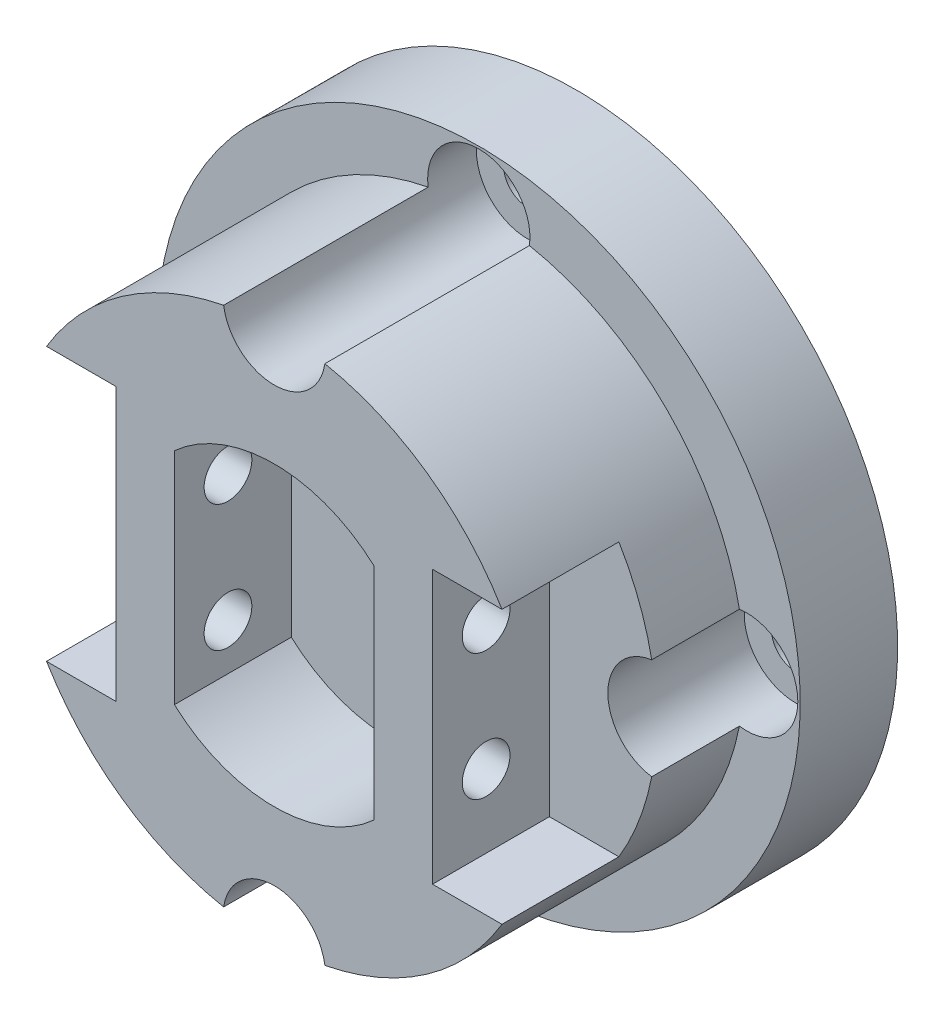
ISO-10303-21;
HEADER;
FILE_DESCRIPTION(('STEP AP214'),'2;1');
FILE_NAME('part.step','',(''),(''),'','','');
FILE_SCHEMA(('AUTOMOTIVE_DESIGN { 1 0 10303 214 1 1 1 1 }'));
ENDSEC;
DATA;
#1=APPLICATION_CONTEXT('core data for automotive mechanical design processes');
#2=APPLICATION_PROTOCOL_DEFINITION('international standard','automotive_design',2000,#1);
#3=PRODUCT_CONTEXT('',#1,'mechanical');
#4=PRODUCT('Part','Part','',(#3));
#5=PRODUCT_RELATED_PRODUCT_CATEGORY('part','',(#4));
#6=PRODUCT_DEFINITION_FORMATION('','',#4);
#7=PRODUCT_DEFINITION_CONTEXT('part definition',#1,'design');
#8=PRODUCT_DEFINITION('design','',#6,#7);
#9=PRODUCT_DEFINITION_SHAPE('','',#8);
#10=(LENGTH_UNIT() NAMED_UNIT(*) SI_UNIT(.MILLI.,.METRE.));
#11=(NAMED_UNIT(*) PLANE_ANGLE_UNIT() SI_UNIT($,.RADIAN.));
#12=(NAMED_UNIT(*) SI_UNIT($,.STERADIAN.) SOLID_ANGLE_UNIT());
#13=UNCERTAINTY_MEASURE_WITH_UNIT(LENGTH_MEASURE(1.E-05),#10,'distance_accuracy_value','');
#14=(GEOMETRIC_REPRESENTATION_CONTEXT(3) GLOBAL_UNCERTAINTY_ASSIGNED_CONTEXT((#13)) GLOBAL_UNIT_ASSIGNED_CONTEXT((#10,
#11,#12)) REPRESENTATION_CONTEXT('',''));
#15=CARTESIAN_POINT('',(0.,0.,0.));
#16=DIRECTION('',(0.,0.,1.));
#17=DIRECTION('',(1.,0.,0.));
#18=AXIS2_PLACEMENT_3D('',#15,#16,#17);
#19=CARTESIAN_POINT('',(0.,-27.5,36.));
#20=DIRECTION('',(0.,0.,-1.));
#21=DIRECTION('',(1.,0.,0.));
#22=AXIS2_PLACEMENT_3D('',#19,#20,#21);
#23=CYLINDRICAL_SURFACE('',#22,2.45);
#24=CARTESIAN_POINT('',(0.,-27.5,0.));
#25=DIRECTION('',(0.,0.,1.));
#26=DIRECTION('',(1.,0.,0.));
#27=AXIS2_PLACEMENT_3D('',#24,#25,#26);
#28=CIRCLE('',#27,2.45);
#29=CARTESIAN_POINT('',(2.45000000000001,-27.5,0.));
#30=VERTEX_POINT('',#29);
#31=EDGE_CURVE('E354',#30,#30,#28,.T.);
#32=ORIENTED_EDGE('',*,*,#31,.F.);
#33=EDGE_LOOP('',(#32));
#34=FACE_BOUND('',#33,.T.);
#35=CARTESIAN_POINT('',(0.,-27.5,5.));
#36=DIRECTION('',(0.,0.,-1.));
#37=DIRECTION('',(-1.,0.,0.));
#38=AXIS2_PLACEMENT_3D('',#35,#36,#37);
#39=CIRCLE('',#38,2.45);
#40=CARTESIAN_POINT('',(-2.45,-27.5,5.));
#41=VERTEX_POINT('',#40);
#42=EDGE_CURVE('E251',#41,#41,#39,.F.);
#43=ORIENTED_EDGE('',*,*,#42,.T.);
#44=EDGE_LOOP('',(#43));
#45=FACE_BOUND('',#44,.T.);
#46=ADVANCED_FACE('F34',(#34,#45),#23,.F.);
#47=CARTESIAN_POINT('',(27.5,0.,36.));
#48=DIRECTION('',(0.,0.,-1.));
#49=DIRECTION('',(1.,0.,0.));
#50=AXIS2_PLACEMENT_3D('',#47,#48,#49);
#51=CYLINDRICAL_SURFACE('',#50,2.45);
#52=CARTESIAN_POINT('',(27.5,0.,0.));
#53=DIRECTION('',(0.,0.,1.));
#54=DIRECTION('',(1.,0.,0.));
#55=AXIS2_PLACEMENT_3D('',#52,#53,#54);
#56=CIRCLE('',#55,2.45);
#57=CARTESIAN_POINT('',(29.95,0.,0.));
#58=VERTEX_POINT('',#57);
#59=EDGE_CURVE('E351',#58,#58,#56,.T.);
#60=ORIENTED_EDGE('',*,*,#59,.F.);
#61=EDGE_LOOP('',(#60));
#62=FACE_BOUND('',#61,.T.);
#63=CARTESIAN_POINT('',(27.5,0.,5.));
#64=DIRECTION('',(0.,0.,-1.));
#65=DIRECTION('',(-1.,0.,0.));
#66=AXIS2_PLACEMENT_3D('',#63,#64,#65);
#67=CIRCLE('',#66,2.45);
#68=CARTESIAN_POINT('',(25.05,0.,5.));
#69=VERTEX_POINT('',#68);
#70=EDGE_CURVE('E247',#69,#69,#67,.F.);
#71=ORIENTED_EDGE('',*,*,#70,.T.);
#72=EDGE_LOOP('',(#71));
#73=FACE_BOUND('',#72,.T.);
#74=ADVANCED_FACE('F427',(#62,#73),#51,.F.);
#75=CARTESIAN_POINT('',(-27.5,0.,36.));
#76=DIRECTION('',(0.,0.,-1.));
#77=DIRECTION('',(1.,0.,0.));
#78=AXIS2_PLACEMENT_3D('',#75,#76,#77);
#79=CYLINDRICAL_SURFACE('',#78,2.45);
#80=CARTESIAN_POINT('',(-27.5,0.,0.));
#81=DIRECTION('',(0.,0.,1.));
#82=DIRECTION('',(1.,0.,0.));
#83=AXIS2_PLACEMENT_3D('',#80,#81,#82);
#84=CIRCLE('',#83,2.45);
#85=CARTESIAN_POINT('',(-25.05,0.,0.));
#86=VERTEX_POINT('',#85);
#87=EDGE_CURVE('E357',#86,#86,#84,.T.);
#88=ORIENTED_EDGE('',*,*,#87,.F.);
#89=EDGE_LOOP('',(#88));
#90=FACE_BOUND('',#89,.T.);
#91=CARTESIAN_POINT('',(-27.5,0.,5.));
#92=DIRECTION('',(0.,0.,-1.));
#93=DIRECTION('',(-1.,0.,0.));
#94=AXIS2_PLACEMENT_3D('',#91,#92,#93);
#95=CIRCLE('',#94,2.45);
#96=CARTESIAN_POINT('',(-29.95,0.,5.));
#97=VERTEX_POINT('',#96);
#98=EDGE_CURVE('E241',#97,#97,#95,.F.);
#99=ORIENTED_EDGE('',*,*,#98,.T.);
#100=EDGE_LOOP('',(#99));
#101=FACE_BOUND('',#100,.T.);
#102=ADVANCED_FACE('F433',(#90,#101),#79,.F.);
#103=CARTESIAN_POINT('',(0.,27.5,36.));
#104=DIRECTION('',(0.,0.,-1.));
#105=DIRECTION('',(1.,0.,0.));
#106=AXIS2_PLACEMENT_3D('',#103,#104,#105);
#107=CYLINDRICAL_SURFACE('',#106,2.45);
#108=CARTESIAN_POINT('',(0.,27.5,0.));
#109=DIRECTION('',(0.,0.,1.));
#110=DIRECTION('',(1.,0.,0.));
#111=AXIS2_PLACEMENT_3D('',#108,#109,#110);
#112=CIRCLE('',#111,2.45);
#113=CARTESIAN_POINT('',(2.44999999999999,27.5,0.));
#114=VERTEX_POINT('',#113);
#115=EDGE_CURVE('E360',#114,#114,#112,.T.);
#116=ORIENTED_EDGE('',*,*,#115,.F.);
#117=EDGE_LOOP('',(#116));
#118=FACE_BOUND('',#117,.T.);
#119=CARTESIAN_POINT('',(0.,27.5,5.));
#120=DIRECTION('',(0.,0.,-1.));
#121=DIRECTION('',(-1.,0.,0.));
#122=AXIS2_PLACEMENT_3D('',#119,#120,#121);
#123=CIRCLE('',#122,2.45);
#124=CARTESIAN_POINT('',(-2.45000000000001,27.5,5.));
#125=VERTEX_POINT('',#124);
#126=EDGE_CURVE('E233',#125,#125,#123,.F.);
#127=ORIENTED_EDGE('',*,*,#126,.T.);
#128=EDGE_LOOP('',(#127));
#129=FACE_BOUND('',#128,.T.);
#130=ADVANCED_FACE('F441',(#118,#129),#107,.F.);
#131=CARTESIAN_POINT('',(0.,0.,31.));
#132=DIRECTION('',(0.,0.,-1.));
#133=DIRECTION('',(1.,0.,0.));
#134=AXIS2_PLACEMENT_3D('',#131,#132,#133);
#135=CYLINDRICAL_SURFACE('',#134,27.25);
#136=CARTESIAN_POINT('',(0.,0.,31.));
#137=DIRECTION('',(0.,0.,-1.));
#138=DIRECTION('',(-1.,0.,0.));
#139=AXIS2_PLACEMENT_3D('',#136,#137,#138);
#140=CIRCLE('',#139,27.25);
#141=CARTESIAN_POINT('',(-5.19615242270663,-26.75,31.));
#142=VERTEX_POINT('',#141);
#143=CARTESIAN_POINT('',(-23.3786761815121,-14.,31.));
#144=VERTEX_POINT('',#143);
#145=EDGE_CURVE('E183',#142,#144,#140,.T.);
#146=ORIENTED_EDGE('',*,*,#145,.T.);
#147=DIRECTION('',(0.,0.,-1.));
#148=VECTOR('',#147,1.);
#149=CARTESIAN_POINT('',(-23.3786761815121,-14.,31.));
#150=LINE('',#149,#148);
#151=CARTESIAN_POINT('',(-23.3786761815121,-14.,19.));
#152=VERTEX_POINT('',#151);
#153=EDGE_CURVE('E309',#144,#152,#150,.T.);
#154=ORIENTED_EDGE('',*,*,#153,.T.);
#155=CARTESIAN_POINT('',(0.,0.,19.));
#156=DIRECTION('',(0.,0.,1.));
#157=DIRECTION('',(1.,0.,0.));
#158=AXIS2_PLACEMENT_3D('',#155,#156,#157);
#159=CIRCLE('',#158,27.25);
#160=CARTESIAN_POINT('',(-26.75,-5.19615242270662,19.));
#161=VERTEX_POINT('',#160);
#162=EDGE_CURVE('E306',#161,#152,#159,.T.);
#163=ORIENTED_EDGE('',*,*,#162,.F.);
#164=DIRECTION('',(0.,0.,1.));
#165=VECTOR('',#164,1.);
#166=CARTESIAN_POINT('',(-26.75,-5.19615242270664,18.));
#167=LINE('',#166,#165);
#168=CARTESIAN_POINT('',(-26.75,-5.19615242270663,10.));
#169=VERTEX_POINT('',#168);
#170=EDGE_CURVE('E273',#169,#161,#167,.T.);
#171=ORIENTED_EDGE('',*,*,#170,.F.);
#172=CARTESIAN_POINT('',(0.,0.,10.));
#173=DIRECTION('',(0.,0.,-1.));
#174=DIRECTION('',(-1.,0.,0.));
#175=AXIS2_PLACEMENT_3D('',#172,#173,#174);
#176=CIRCLE('',#175,27.25);
#177=CARTESIAN_POINT('',(-5.19615242270661,-26.75,10.));
#178=VERTEX_POINT('',#177);
#179=EDGE_CURVE('E186',#178,#169,#176,.T.);
#180=ORIENTED_EDGE('',*,*,#179,.F.);
#181=DIRECTION('',(0.,0.,1.));
#182=VECTOR('',#181,1.);
#183=CARTESIAN_POINT('',(-5.19615242270663,-26.75,18.));
#184=LINE('',#183,#182);
#185=EDGE_CURVE('E170',#142,#178,#184,.F.);
#186=ORIENTED_EDGE('',*,*,#185,.F.);
#187=EDGE_LOOP('',(#146,#154,#163,#171,#180,#186));
#188=FACE_BOUND('',#187,.T.);
#189=ADVANCED_FACE('F181',(#188),#135,.T.);
#190=CARTESIAN_POINT('',(0.,0.,19.));
#191=DIRECTION('',(0.,0.,1.));
#192=DIRECTION('',(1.,0.,0.));
#193=AXIS2_PLACEMENT_3D('',#190,#191,#192);
#194=CIRCLE('',#193,27.25);
#195=CARTESIAN_POINT('',(-23.3786761815121,14.,19.));
#196=VERTEX_POINT('',#195);
#197=CARTESIAN_POINT('',(-26.75,5.19615242270661,19.));
#198=VERTEX_POINT('',#197);
#199=EDGE_CURVE('E303',#196,#198,#194,.T.);
#200=ORIENTED_EDGE('',*,*,#199,.F.);
#201=DIRECTION('',(0.,0.,-1.));
#202=VECTOR('',#201,1.);
#203=CARTESIAN_POINT('',(-23.3786761815121,14.,31.));
#204=LINE('',#203,#202);
#205=CARTESIAN_POINT('',(-23.3786761815121,14.,31.));
#206=VERTEX_POINT('',#205);
#207=EDGE_CURVE('E311',#196,#206,#204,.F.);
#208=ORIENTED_EDGE('',*,*,#207,.T.);
#209=CARTESIAN_POINT('',(-5.19615242270664,26.75,31.));
#210=VERTEX_POINT('',#209);
#211=EDGE_CURVE('E196',#206,#210,#140,.T.);
#212=ORIENTED_EDGE('',*,*,#211,.T.);
#213=DIRECTION('',(0.,0.,1.));
#214=VECTOR('',#213,1.);
#215=CARTESIAN_POINT('',(-5.19615242270664,26.75,18.));
#216=LINE('',#215,#214);
#217=CARTESIAN_POINT('',(-5.19615242270662,26.75,10.));
#218=VERTEX_POINT('',#217);
#219=EDGE_CURVE('E282',#218,#210,#216,.T.);
#220=ORIENTED_EDGE('',*,*,#219,.F.);
#221=CARTESIAN_POINT('',(-26.75,5.19615242270662,10.));
#222=VERTEX_POINT('',#221);
#223=EDGE_CURVE('E388',#222,#218,#176,.T.);
#224=ORIENTED_EDGE('',*,*,#223,.F.);
#225=DIRECTION('',(0.,0.,1.));
#226=VECTOR('',#225,1.);
#227=CARTESIAN_POINT('',(-26.75,5.19615242270663,18.));
#228=LINE('',#227,#226);
#229=EDGE_CURVE('E270',#198,#222,#228,.F.);
#230=ORIENTED_EDGE('',*,*,#229,.F.);
#231=EDGE_LOOP('',(#200,#208,#212,#220,#224,#230));
#232=FACE_BOUND('',#231,.T.);
#233=ADVANCED_FACE('F523',(#232),#135,.T.);
#234=CARTESIAN_POINT('',(0.,0.,31.));
#235=DIRECTION('',(0.,0.,1.));
#236=DIRECTION('',(-1.,0.,0.));
#237=AXIS2_PLACEMENT_3D('',#234,#235,#236);
#238=PLANE('',#237);
#239=CARTESIAN_POINT('',(0.,-27.5,31.));
#240=DIRECTION('',(0.,0.,-1.));
#241=DIRECTION('',(-1.,0.,0.));
#242=AXIS2_PLACEMENT_3D('',#239,#240,#241);
#243=CIRCLE('',#242,5.25);
#244=CARTESIAN_POINT('',(5.19615242270664,-26.75,31.));
#245=VERTEX_POINT('',#244);
#246=EDGE_CURVE('E167',#142,#245,#243,.T.);
#247=ORIENTED_EDGE('',*,*,#246,.T.);
#248=CARTESIAN_POINT('',(23.3786761815121,-14.,31.));
#249=VERTEX_POINT('',#248);
#250=EDGE_CURVE('E195',#249,#245,#140,.T.);
#251=ORIENTED_EDGE('',*,*,#250,.F.);
#252=DIRECTION('',(-1.,0.,0.));
#253=VECTOR('',#252,1.);
#254=CARTESIAN_POINT('',(16.25,-14.,31.));
#255=LINE('',#254,#253);
#256=CARTESIAN_POINT('',(16.25,-14.,31.));
#257=VERTEX_POINT('',#256);
#258=EDGE_CURVE('E318',#249,#257,#255,.T.);
#259=ORIENTED_EDGE('',*,*,#258,.T.);
#260=DIRECTION('',(0.,1.,0.));
#261=VECTOR('',#260,1.);
#262=CARTESIAN_POINT('',(16.25,14.,31.));
#263=LINE('',#262,#261);
#264=CARTESIAN_POINT('',(16.25,14.,31.));
#265=VERTEX_POINT('',#264);
#266=EDGE_CURVE('E314',#257,#265,#263,.T.);
#267=ORIENTED_EDGE('',*,*,#266,.T.);
#268=DIRECTION('',(1.,0.,0.));
#269=VECTOR('',#268,1.);
#270=CARTESIAN_POINT('',(16.25,14.,31.));
#271=LINE('',#270,#269);
#272=CARTESIAN_POINT('',(23.3786761815121,14.,31.));
#273=VERTEX_POINT('',#272);
#274=EDGE_CURVE('E326',#265,#273,#271,.T.);
#275=ORIENTED_EDGE('',*,*,#274,.T.);
#276=CARTESIAN_POINT('',(5.19615242270662,26.75,31.));
#277=VERTEX_POINT('',#276);
#278=EDGE_CURVE('E198',#277,#273,#140,.T.);
#279=ORIENTED_EDGE('',*,*,#278,.F.);
#280=CARTESIAN_POINT('',(0.,27.5,31.));
#281=DIRECTION('',(0.,0.,-1.));
#282=DIRECTION('',(-1.,0.,0.));
#283=AXIS2_PLACEMENT_3D('',#280,#281,#282);
#284=CIRCLE('',#283,5.25);
#285=EDGE_CURVE('E244',#277,#210,#284,.T.);
#286=ORIENTED_EDGE('',*,*,#285,.T.);
#287=ORIENTED_EDGE('',*,*,#211,.F.);
#288=DIRECTION('',(-1.,0.,0.));
#289=VECTOR('',#288,1.);
#290=CARTESIAN_POINT('',(-16.25,14.,31.));
#291=LINE('',#290,#289);
#292=CARTESIAN_POINT('',(-16.25,14.,31.));
#293=VERTEX_POINT('',#292);
#294=EDGE_CURVE('E289',#293,#206,#291,.T.);
#295=ORIENTED_EDGE('',*,*,#294,.F.);
#296=DIRECTION('',(0.,1.,0.));
#297=VECTOR('',#296,1.);
#298=CARTESIAN_POINT('',(-16.25,14.,31.));
#299=LINE('',#298,#297);
#300=CARTESIAN_POINT('',(-16.25,-14.,31.));
#301=VERTEX_POINT('',#300);
#302=EDGE_CURVE('E285',#301,#293,#299,.T.);
#303=ORIENTED_EDGE('',*,*,#302,.F.);
#304=DIRECTION('',(1.,0.,0.));
#305=VECTOR('',#304,1.);
#306=CARTESIAN_POINT('',(-16.25,-14.,31.));
#307=LINE('',#306,#305);
#308=EDGE_CURVE('E193',#144,#301,#307,.T.);
#309=ORIENTED_EDGE('',*,*,#308,.F.);
#310=ORIENTED_EDGE('',*,*,#145,.F.);
#311=EDGE_LOOP('',(#247,#251,#259,#267,#275,#279,#286,#287,#295,#303,#309,#310));
#312=FACE_BOUND('',#311,.T.);
#313=CARTESIAN_POINT('',(0.,0.,31.));
#314=DIRECTION('',(0.,0.,-1.));
#315=DIRECTION('',(-1.,0.,0.));
#316=AXIS2_PLACEMENT_3D('',#313,#314,#315);
#317=CIRCLE('',#316,15.25);
#318=CARTESIAN_POINT('',(-10.25,11.2915897906362,31.));
#319=VERTEX_POINT('',#318);
#320=CARTESIAN_POINT('',(10.25,11.2915897906362,31.));
#321=VERTEX_POINT('',#320);
#322=EDGE_CURVE('E363',#319,#321,#317,.T.);
#323=ORIENTED_EDGE('',*,*,#322,.T.);
#324=DIRECTION('',(0.,-1.,0.));
#325=VECTOR('',#324,1.);
#326=CARTESIAN_POINT('',(10.25,11.2915897906362,31.));
#327=LINE('',#326,#325);
#328=CARTESIAN_POINT('',(10.25,-11.2915897906362,31.));
#329=VERTEX_POINT('',#328);
#330=EDGE_CURVE('E378',#321,#329,#327,.T.);
#331=ORIENTED_EDGE('',*,*,#330,.T.);
#332=CARTESIAN_POINT('',(0.,0.,31.));
#333=DIRECTION('',(0.,0.,-1.));
#334=DIRECTION('',(-1.,0.,0.));
#335=AXIS2_PLACEMENT_3D('',#332,#333,#334);
#336=CIRCLE('',#335,15.25);
#337=CARTESIAN_POINT('',(-10.25,-11.2915897906362,31.));
#338=VERTEX_POINT('',#337);
#339=EDGE_CURVE('E381',#329,#338,#336,.T.);
#340=ORIENTED_EDGE('',*,*,#339,.T.);
#341=DIRECTION('',(0.,1.,0.));
#342=VECTOR('',#341,1.);
#343=CARTESIAN_POINT('',(-10.25,11.2915897906362,31.));
#344=LINE('',#343,#342);
#345=EDGE_CURVE('E367',#338,#319,#344,.T.);
#346=ORIENTED_EDGE('',*,*,#345,.T.);
#347=EDGE_LOOP('',(#323,#331,#340,#346));
#348=FACE_BOUND('',#347,.T.);
#349=ADVANCED_FACE('F189',(#312,#348),#238,.T.);
#350=CARTESIAN_POINT('',(27.75,6.49999999999999,25.5));
#351=DIRECTION('',(-1.,0.,0.));
#352=DIRECTION('',(0.,1.,0.));
#353=AXIS2_PLACEMENT_3D('',#350,#351,#352);
#354=CYLINDRICAL_SURFACE('',#353,2.45);
#355=CARTESIAN_POINT('',(-10.25,6.5,25.5));
#356=DIRECTION('',(1.,0.,0.));
#357=DIRECTION('',(0.,1.,0.));
#358=AXIS2_PLACEMENT_3D('',#355,#356,#357);
#359=CIRCLE('',#358,2.45);
#360=CARTESIAN_POINT('',(-10.25,8.95,25.5));
#361=VERTEX_POINT('',#360);
#362=EDGE_CURVE('E221',#361,#361,#359,.F.);
#363=ORIENTED_EDGE('',*,*,#362,.F.);
#364=EDGE_LOOP('',(#363));
#365=FACE_BOUND('',#364,.T.);
#366=CARTESIAN_POINT('',(-16.25,6.50000000000001,25.5));
#367=DIRECTION('',(1.,0.,0.));
#368=DIRECTION('',(0.,1.,0.));
#369=AXIS2_PLACEMENT_3D('',#366,#367,#368);
#370=CIRCLE('',#369,2.45);
#371=CARTESIAN_POINT('',(-16.25,8.95000000000001,25.5));
#372=VERTEX_POINT('',#371);
#373=EDGE_CURVE('E231',#372,#372,#370,.T.);
#374=ORIENTED_EDGE('',*,*,#373,.F.);
#375=EDGE_LOOP('',(#374));
#376=FACE_BOUND('',#375,.T.);
#377=ADVANCED_FACE('F454',(#365,#376),#354,.F.);
#378=CARTESIAN_POINT('',(27.75,-6.50000000000001,25.5));
#379=DIRECTION('',(-1.,0.,0.));
#380=DIRECTION('',(0.,1.,0.));
#381=AXIS2_PLACEMENT_3D('',#378,#379,#380);
#382=CYLINDRICAL_SURFACE('',#381,2.45);
#383=CARTESIAN_POINT('',(-10.25,-6.5,25.5));
#384=DIRECTION('',(1.,0.,0.));
#385=DIRECTION('',(0.,1.,0.));
#386=AXIS2_PLACEMENT_3D('',#383,#384,#385);
#387=CIRCLE('',#386,2.45);
#388=CARTESIAN_POINT('',(-10.25,-4.05,25.5));
#389=VERTEX_POINT('',#388);
#390=EDGE_CURVE('E222',#389,#389,#387,.F.);
#391=ORIENTED_EDGE('',*,*,#390,.F.);
#392=EDGE_LOOP('',(#391));
#393=FACE_BOUND('',#392,.T.);
#394=CARTESIAN_POINT('',(-16.25,-6.49999999999999,25.5));
#395=DIRECTION('',(1.,0.,0.));
#396=DIRECTION('',(0.,1.,0.));
#397=AXIS2_PLACEMENT_3D('',#394,#395,#396);
#398=CIRCLE('',#397,2.45);
#399=CARTESIAN_POINT('',(-16.25,-4.04999999999999,25.5));
#400=VERTEX_POINT('',#399);
#401=EDGE_CURVE('E228',#400,#400,#398,.T.);
#402=ORIENTED_EDGE('',*,*,#401,.F.);
#403=EDGE_LOOP('',(#402));
#404=FACE_BOUND('',#403,.T.);
#405=ADVANCED_FACE('F446',(#393,#404),#382,.F.);
#406=CARTESIAN_POINT('',(-10.25,11.2915897906362,19.));
#407=DIRECTION('',(-1.,0.,0.));
#408=DIRECTION('',(0.,1.,0.));
#409=AXIS2_PLACEMENT_3D('',#406,#407,#408);
#410=PLANE('',#409);
#411=ORIENTED_EDGE('',*,*,#362,.T.);
#412=EDGE_LOOP('',(#411));
#413=FACE_BOUND('',#412,.T.);
#414=ORIENTED_EDGE('',*,*,#345,.F.);
#415=DIRECTION('',(0.,0.,1.));
#416=VECTOR('',#415,1.);
#417=CARTESIAN_POINT('',(-10.25,-11.2915897906362,19.));
#418=LINE('',#417,#416);
#419=CARTESIAN_POINT('',(-10.25,-11.2915897906362,19.));
#420=VERTEX_POINT('',#419);
#421=EDGE_CURVE('E389',#420,#338,#418,.T.);
#422=ORIENTED_EDGE('',*,*,#421,.F.);
#423=DIRECTION('',(0.,1.,0.));
#424=VECTOR('',#423,1.);
#425=CARTESIAN_POINT('',(-10.25,11.2915897906362,19.));
#426=LINE('',#425,#424);
#427=CARTESIAN_POINT('',(-10.25,11.2915897906362,19.));
#428=VERTEX_POINT('',#427);
#429=EDGE_CURVE('E372',#420,#428,#426,.T.);
#430=ORIENTED_EDGE('',*,*,#429,.T.);
#431=DIRECTION('',(0.,0.,1.));
#432=VECTOR('',#431,1.);
#433=CARTESIAN_POINT('',(-10.25,11.2915897906362,19.));
#434=LINE('',#433,#432);
#435=EDGE_CURVE('E386',#428,#319,#434,.T.);
#436=ORIENTED_EDGE('',*,*,#435,.T.);
#437=EDGE_LOOP('',(#414,#422,#430,#436));
#438=FACE_BOUND('',#437,.T.);
#439=ORIENTED_EDGE('',*,*,#390,.T.);
#440=EDGE_LOOP('',(#439));
#441=FACE_BOUND('',#440,.T.);
#442=ADVANCED_FACE('F407',(#413,#438,#441),#410,.F.);
#443=CARTESIAN_POINT('',(10.25,11.2915897906362,19.));
#444=DIRECTION('',(1.,0.,0.));
#445=DIRECTION('',(0.,0.,1.));
#446=AXIS2_PLACEMENT_3D('',#443,#444,#445);
#447=PLANE('',#446);
#448=CARTESIAN_POINT('',(10.25,6.5,25.5));
#449=DIRECTION('',(-1.,0.,0.));
#450=DIRECTION('',(0.,0.,1.));
#451=AXIS2_PLACEMENT_3D('',#448,#449,#450);
#452=CIRCLE('',#451,2.45);
#453=CARTESIAN_POINT('',(10.25,6.5,27.95));
#454=VERTEX_POINT('',#453);
#455=EDGE_CURVE('E218',#454,#454,#452,.F.);
#456=ORIENTED_EDGE('',*,*,#455,.T.);
#457=EDGE_LOOP('',(#456));
#458=FACE_BOUND('',#457,.T.);
#459=ORIENTED_EDGE('',*,*,#330,.F.);
#460=DIRECTION('',(0.,0.,1.));
#461=VECTOR('',#460,1.);
#462=CARTESIAN_POINT('',(10.25,11.2915897906362,19.));
#463=LINE('',#462,#461);
#464=CARTESIAN_POINT('',(10.25,11.2915897906362,19.));
#465=VERTEX_POINT('',#464);
#466=EDGE_CURVE('E375',#465,#321,#463,.T.);
#467=ORIENTED_EDGE('',*,*,#466,.F.);
#468=DIRECTION('',(0.,-1.,0.));
#469=VECTOR('',#468,1.);
#470=CARTESIAN_POINT('',(10.25,11.2915897906362,19.));
#471=LINE('',#470,#469);
#472=CARTESIAN_POINT('',(10.25,-11.2915897906362,19.));
#473=VERTEX_POINT('',#472);
#474=EDGE_CURVE('E366',#465,#473,#471,.T.);
#475=ORIENTED_EDGE('',*,*,#474,.T.);
#476=DIRECTION('',(0.,0.,1.));
#477=VECTOR('',#476,1.);
#478=CARTESIAN_POINT('',(10.25,-11.2915897906362,19.));
#479=LINE('',#478,#477);
#480=EDGE_CURVE('E391',#473,#329,#479,.T.);
#481=ORIENTED_EDGE('',*,*,#480,.T.);
#482=EDGE_LOOP('',(#459,#467,#475,#481));
#483=FACE_BOUND('',#482,.T.);
#484=CARTESIAN_POINT('',(10.25,-6.5,25.5));
#485=DIRECTION('',(-1.,0.,0.));
#486=DIRECTION('',(0.,0.,1.));
#487=AXIS2_PLACEMENT_3D('',#484,#485,#486);
#488=CIRCLE('',#487,2.45);
#489=CARTESIAN_POINT('',(10.25,-6.5,27.95));
#490=VERTEX_POINT('',#489);
#491=EDGE_CURVE('E344',#490,#490,#488,.F.);
#492=ORIENTED_EDGE('',*,*,#491,.T.);
#493=EDGE_LOOP('',(#492));
#494=FACE_BOUND('',#493,.T.);
#495=ADVANCED_FACE('F400',(#458,#483,#494),#447,.F.);
#496=CARTESIAN_POINT('',(26.75,-5.19615242270665,10.));
#497=VERTEX_POINT('',#496);
#498=CARTESIAN_POINT('',(5.19615242270662,-26.75,10.));
#499=VERTEX_POINT('',#498);
#500=EDGE_CURVE('E495',#497,#499,#176,.T.);
#501=ORIENTED_EDGE('',*,*,#500,.F.);
#502=DIRECTION('',(0.,0.,1.));
#503=VECTOR('',#502,1.);
#504=CARTESIAN_POINT('',(26.75,-5.19615242270664,18.));
#505=LINE('',#504,#503);
#506=CARTESIAN_POINT('',(26.75,-5.19615242270662,19.));
#507=VERTEX_POINT('',#506);
#508=EDGE_CURVE('E265',#507,#497,#505,.F.);
#509=ORIENTED_EDGE('',*,*,#508,.F.);
#510=CARTESIAN_POINT('',(0.,0.,19.));
#511=DIRECTION('',(0.,0.,1.));
#512=DIRECTION('',(1.,0.,0.));
#513=AXIS2_PLACEMENT_3D('',#510,#511,#512);
#514=CIRCLE('',#513,27.25);
#515=CARTESIAN_POINT('',(23.3786761815121,-14.,19.));
#516=VERTEX_POINT('',#515);
#517=EDGE_CURVE('E337',#516,#507,#514,.T.);
#518=ORIENTED_EDGE('',*,*,#517,.F.);
#519=DIRECTION('',(0.,0.,-1.));
#520=VECTOR('',#519,1.);
#521=CARTESIAN_POINT('',(23.3786761815121,-14.,31.));
#522=LINE('',#521,#520);
#523=EDGE_CURVE('E341',#249,#516,#522,.T.);
#524=ORIENTED_EDGE('',*,*,#523,.F.);
#525=ORIENTED_EDGE('',*,*,#250,.T.);
#526=DIRECTION('',(0.,0.,1.));
#527=VECTOR('',#526,1.);
#528=CARTESIAN_POINT('',(5.19615242270664,-26.75,18.));
#529=LINE('',#528,#527);
#530=EDGE_CURVE('E172',#499,#245,#529,.T.);
#531=ORIENTED_EDGE('',*,*,#530,.F.);
#532=EDGE_LOOP('',(#501,#509,#518,#524,#525,#531));
#533=FACE_BOUND('',#532,.T.);
#534=ADVANCED_FACE('F452',(#533),#135,.T.);
#535=CARTESIAN_POINT('',(5.1961524227066,26.75,10.));
#536=VERTEX_POINT('',#535);
#537=CARTESIAN_POINT('',(26.75,5.19615242270663,10.));
#538=VERTEX_POINT('',#537);
#539=EDGE_CURVE('E200',#536,#538,#176,.T.);
#540=ORIENTED_EDGE('',*,*,#539,.F.);
#541=DIRECTION('',(0.,0.,1.));
#542=VECTOR('',#541,1.);
#543=CARTESIAN_POINT('',(5.19615242270662,26.75,18.));
#544=LINE('',#543,#542);
#545=EDGE_CURVE('E236',#277,#536,#544,.F.);
#546=ORIENTED_EDGE('',*,*,#545,.F.);
#547=ORIENTED_EDGE('',*,*,#278,.T.);
#548=DIRECTION('',(0.,0.,-1.));
#549=VECTOR('',#548,1.);
#550=CARTESIAN_POINT('',(23.3786761815121,14.,31.));
#551=LINE('',#550,#549);
#552=CARTESIAN_POINT('',(23.3786761815121,14.,19.));
#553=VERTEX_POINT('',#552);
#554=EDGE_CURVE('E339',#553,#273,#551,.F.);
#555=ORIENTED_EDGE('',*,*,#554,.F.);
#556=CARTESIAN_POINT('',(0.,0.,19.));
#557=DIRECTION('',(0.,0.,1.));
#558=DIRECTION('',(1.,0.,0.));
#559=AXIS2_PLACEMENT_3D('',#556,#557,#558);
#560=CIRCLE('',#559,27.25);
#561=CARTESIAN_POINT('',(26.75,5.19615242270661,19.));
#562=VERTEX_POINT('',#561);
#563=EDGE_CURVE('E334',#562,#553,#560,.T.);
#564=ORIENTED_EDGE('',*,*,#563,.F.);
#565=DIRECTION('',(0.,0.,1.));
#566=VECTOR('',#565,1.);
#567=CARTESIAN_POINT('',(26.75,5.19615242270663,18.));
#568=LINE('',#567,#566);
#569=EDGE_CURVE('E263',#538,#562,#568,.T.);
#570=ORIENTED_EDGE('',*,*,#569,.F.);
#571=EDGE_LOOP('',(#540,#546,#547,#555,#564,#570));
#572=FACE_BOUND('',#571,.T.);
#573=ADVANCED_FACE('F499',(#572),#135,.T.);
#574=CARTESIAN_POINT('',(0.,0.,10.));
#575=DIRECTION('',(0.,0.,1.));
#576=DIRECTION('',(-1.,0.,0.));
#577=AXIS2_PLACEMENT_3D('',#574,#575,#576);
#578=PLANE('',#577);
#579=CARTESIAN_POINT('',(0.,-27.5,10.));
#580=DIRECTION('',(0.,0.,-1.));
#581=DIRECTION('',(-1.,0.,0.));
#582=AXIS2_PLACEMENT_3D('',#579,#580,#581);
#583=CIRCLE('',#582,5.25);
#584=EDGE_CURVE('E12',#499,#178,#583,.T.);
#585=ORIENTED_EDGE('',*,*,#584,.T.);
#586=ORIENTED_EDGE('',*,*,#179,.T.);
#587=CARTESIAN_POINT('',(-27.5,0.,10.));
#588=DIRECTION('',(0.,0.,-1.));
#589=DIRECTION('',(-1.,0.,0.));
#590=AXIS2_PLACEMENT_3D('',#587,#588,#589);
#591=CIRCLE('',#590,5.25);
#592=EDGE_CURVE('E245',#169,#222,#591,.T.);
#593=ORIENTED_EDGE('',*,*,#592,.T.);
#594=ORIENTED_EDGE('',*,*,#223,.T.);
#595=CARTESIAN_POINT('',(0.,27.5,10.));
#596=DIRECTION('',(0.,0.,-1.));
#597=DIRECTION('',(-1.,0.,0.));
#598=AXIS2_PLACEMENT_3D('',#595,#596,#597);
#599=CIRCLE('',#598,5.25);
#600=EDGE_CURVE('E215',#218,#536,#599,.T.);
#601=ORIENTED_EDGE('',*,*,#600,.T.);
#602=ORIENTED_EDGE('',*,*,#539,.T.);
#603=CARTESIAN_POINT('',(27.5,0.,10.));
#604=DIRECTION('',(0.,0.,-1.));
#605=DIRECTION('',(-1.,0.,0.));
#606=AXIS2_PLACEMENT_3D('',#603,#604,#605);
#607=CIRCLE('',#606,5.25);
#608=EDGE_CURVE('E250',#538,#497,#607,.T.);
#609=ORIENTED_EDGE('',*,*,#608,.T.);
#610=ORIENTED_EDGE('',*,*,#500,.T.);
#611=EDGE_LOOP('',(#585,#586,#593,#594,#601,#602,#609,#610));
#612=FACE_BOUND('',#611,.T.);
#613=CARTESIAN_POINT('',(0.,0.,10.));
#614=DIRECTION('',(0.,0.,-1.));
#615=DIRECTION('',(-1.,0.,0.));
#616=AXIS2_PLACEMENT_3D('',#613,#614,#615);
#617=CIRCLE('',#616,33.);
#618=CARTESIAN_POINT('',(-33.,0.,10.));
#619=VERTEX_POINT('',#618);
#620=EDGE_CURVE('E210',#619,#619,#617,.T.);
#621=ORIENTED_EDGE('',*,*,#620,.F.);
#622=EDGE_LOOP('',(#621));
#623=FACE_BOUND('',#622,.T.);
#624=ADVANCED_FACE('F492',(#612,#623),#578,.T.);
#625=CARTESIAN_POINT('',(0.,0.,10.));
#626=DIRECTION('',(0.,0.,-1.));
#627=DIRECTION('',(1.,0.,0.));
#628=AXIS2_PLACEMENT_3D('',#625,#626,#627);
#629=CYLINDRICAL_SURFACE('',#628,33.);
#630=ORIENTED_EDGE('',*,*,#620,.T.);
#631=EDGE_LOOP('',(#630));
#632=FACE_BOUND('',#631,.T.);
#633=CARTESIAN_POINT('',(0.,0.,0.));
#634=DIRECTION('',(0.,0.,-1.));
#635=DIRECTION('',(-1.,0.,0.));
#636=AXIS2_PLACEMENT_3D('',#633,#634,#635);
#637=CIRCLE('',#636,33.);
#638=CARTESIAN_POINT('',(-33.,0.,0.));
#639=VERTEX_POINT('',#638);
#640=EDGE_CURVE('E204',#639,#639,#637,.T.);
#641=ORIENTED_EDGE('',*,*,#640,.F.);
#642=EDGE_LOOP('',(#641));
#643=FACE_BOUND('',#642,.T.);
#644=ADVANCED_FACE('F36',(#632,#643),#629,.T.);
#645=CARTESIAN_POINT('',(0.,0.,0.));
#646=DIRECTION('',(0.,0.,1.));
#647=DIRECTION('',(-1.,0.,0.));
#648=AXIS2_PLACEMENT_3D('',#645,#646,#647);
#649=PLANE('',#648);
#650=ORIENTED_EDGE('',*,*,#59,.T.);
#651=EDGE_LOOP('',(#650));
#652=FACE_BOUND('',#651,.T.);
#653=ORIENTED_EDGE('',*,*,#31,.T.);
#654=EDGE_LOOP('',(#653));
#655=FACE_BOUND('',#654,.T.);
#656=ORIENTED_EDGE('',*,*,#87,.T.);
#657=EDGE_LOOP('',(#656));
#658=FACE_BOUND('',#657,.T.);
#659=ORIENTED_EDGE('',*,*,#115,.T.);
#660=EDGE_LOOP('',(#659));
#661=FACE_BOUND('',#660,.T.);
#662=ORIENTED_EDGE('',*,*,#640,.T.);
#663=EDGE_LOOP('',(#662));
#664=FACE_BOUND('',#663,.T.);
#665=ADVANCED_FACE('F422',(#652,#655,#658,#661,#664),#649,.F.);
#666=CARTESIAN_POINT('',(0.,0.,19.));
#667=DIRECTION('',(0.,0.,1.));
#668=DIRECTION('',(-1.,0.,0.));
#669=AXIS2_PLACEMENT_3D('',#666,#667,#668);
#670=CYLINDRICAL_SURFACE('',#669,15.25);
#671=ORIENTED_EDGE('',*,*,#322,.F.);
#672=ORIENTED_EDGE('',*,*,#435,.F.);
#673=CARTESIAN_POINT('',(0.,0.,19.));
#674=DIRECTION('',(0.,0.,-1.));
#675=DIRECTION('',(-1.,0.,0.));
#676=AXIS2_PLACEMENT_3D('',#673,#674,#675);
#677=CIRCLE('',#676,15.25);
#678=EDGE_CURVE('E364',#428,#465,#677,.T.);
#679=ORIENTED_EDGE('',*,*,#678,.T.);
#680=ORIENTED_EDGE('',*,*,#466,.T.);
#681=EDGE_LOOP('',(#671,#672,#679,#680));
#682=FACE_BOUND('',#681,.T.);
#683=ADVANCED_FACE('F396',(#682),#670,.F.);
#684=CARTESIAN_POINT('',(0.,0.,19.));
#685=DIRECTION('',(0.,0.,1.));
#686=DIRECTION('',(-1.,0.,0.));
#687=AXIS2_PLACEMENT_3D('',#684,#685,#686);
#688=CYLINDRICAL_SURFACE('',#687,15.25);
#689=ORIENTED_EDGE('',*,*,#339,.F.);
#690=ORIENTED_EDGE('',*,*,#480,.F.);
#691=CARTESIAN_POINT('',(0.,0.,19.));
#692=DIRECTION('',(0.,0.,-1.));
#693=DIRECTION('',(-1.,0.,0.));
#694=AXIS2_PLACEMENT_3D('',#691,#692,#693);
#695=CIRCLE('',#694,15.25);
#696=EDGE_CURVE('E370',#473,#420,#695,.T.);
#697=ORIENTED_EDGE('',*,*,#696,.T.);
#698=ORIENTED_EDGE('',*,*,#421,.T.);
#699=EDGE_LOOP('',(#689,#690,#697,#698));
#700=FACE_BOUND('',#699,.T.);
#701=ADVANCED_FACE('F413',(#700),#688,.F.);
#702=CARTESIAN_POINT('',(0.,0.,19.));
#703=DIRECTION('',(0.,0.,1.));
#704=DIRECTION('',(-1.,0.,0.));
#705=AXIS2_PLACEMENT_3D('',#702,#703,#704);
#706=PLANE('',#705);
#707=ORIENTED_EDGE('',*,*,#678,.F.);
#708=ORIENTED_EDGE('',*,*,#429,.F.);
#709=ORIENTED_EDGE('',*,*,#696,.F.);
#710=ORIENTED_EDGE('',*,*,#474,.F.);
#711=EDGE_LOOP('',(#707,#708,#709,#710));
#712=FACE_BOUND('',#711,.T.);
#713=ADVANCED_FACE('F411',(#712),#706,.T.);
#714=CARTESIAN_POINT('',(16.25,6.49999999999999,25.5));
#715=DIRECTION('',(1.,0.,0.));
#716=DIRECTION('',(0.,1.,0.));
#717=AXIS2_PLACEMENT_3D('',#714,#715,#716);
#718=CIRCLE('',#717,2.45);
#719=CARTESIAN_POINT('',(16.25,8.95,25.5));
#720=VERTEX_POINT('',#719);
#721=EDGE_CURVE('E226',#720,#720,#718,.T.);
#722=ORIENTED_EDGE('',*,*,#721,.T.);
#723=EDGE_LOOP('',(#722));
#724=FACE_BOUND('',#723,.T.);
#725=ORIENTED_EDGE('',*,*,#455,.F.);
#726=EDGE_LOOP('',(#725));
#727=FACE_BOUND('',#726,.T.);
#728=ADVANCED_FACE('F420',(#724,#727),#354,.F.);
#729=CARTESIAN_POINT('',(16.25,-6.50000000000001,25.5));
#730=DIRECTION('',(1.,0.,0.));
#731=DIRECTION('',(0.,1.,0.));
#732=AXIS2_PLACEMENT_3D('',#729,#730,#731);
#733=CIRCLE('',#732,2.45);
#734=CARTESIAN_POINT('',(16.25,-4.05,25.5));
#735=VERTEX_POINT('',#734);
#736=EDGE_CURVE('E223',#735,#735,#733,.T.);
#737=ORIENTED_EDGE('',*,*,#736,.T.);
#738=EDGE_LOOP('',(#737));
#739=FACE_BOUND('',#738,.T.);
#740=ORIENTED_EDGE('',*,*,#491,.F.);
#741=EDGE_LOOP('',(#740));
#742=FACE_BOUND('',#741,.T.);
#743=ADVANCED_FACE('F457',(#739,#742),#382,.F.);
#744=CARTESIAN_POINT('',(16.25,-14.,19.));
#745=DIRECTION('',(0.,-1.,0.));
#746=DIRECTION('',(-1.,0.,0.));
#747=AXIS2_PLACEMENT_3D('',#744,#745,#746);
#748=PLANE('',#747);
#749=ORIENTED_EDGE('',*,*,#258,.F.);
#750=ORIENTED_EDGE('',*,*,#523,.T.);
#751=DIRECTION('',(-1.,0.,0.));
#752=VECTOR('',#751,1.);
#753=CARTESIAN_POINT('',(16.25,-14.,19.));
#754=LINE('',#753,#752);
#755=CARTESIAN_POINT('',(16.25,-14.,19.));
#756=VERTEX_POINT('',#755);
#757=EDGE_CURVE('E320',#516,#756,#754,.T.);
#758=ORIENTED_EDGE('',*,*,#757,.T.);
#759=DIRECTION('',(0.,0.,1.));
#760=VECTOR('',#759,1.);
#761=CARTESIAN_POINT('',(16.25,-14.,19.));
#762=LINE('',#761,#760);
#763=EDGE_CURVE('E227',#756,#257,#762,.T.);
#764=ORIENTED_EDGE('',*,*,#763,.T.);
#765=EDGE_LOOP('',(#749,#750,#758,#764));
#766=FACE_BOUND('',#765,.T.);
#767=ADVANCED_FACE('F511',(#766),#748,.F.);
#768=CARTESIAN_POINT('',(16.25,14.,19.));
#769=DIRECTION('',(0.,1.,0.));
#770=DIRECTION('',(1.,0.,0.));
#771=AXIS2_PLACEMENT_3D('',#768,#769,#770);
#772=PLANE('',#771);
#773=DIRECTION('',(1.,0.,0.));
#774=VECTOR('',#773,1.);
#775=CARTESIAN_POINT('',(16.25,14.,19.));
#776=LINE('',#775,#774);
#777=CARTESIAN_POINT('',(16.25,14.,19.));
#778=VERTEX_POINT('',#777);
#779=EDGE_CURVE('E317',#778,#553,#776,.T.);
#780=ORIENTED_EDGE('',*,*,#779,.T.);
#781=ORIENTED_EDGE('',*,*,#554,.T.);
#782=ORIENTED_EDGE('',*,*,#274,.F.);
#783=DIRECTION('',(0.,0.,1.));
#784=VECTOR('',#783,1.);
#785=CARTESIAN_POINT('',(16.25,14.,19.));
#786=LINE('',#785,#784);
#787=EDGE_CURVE('E323',#778,#265,#786,.T.);
#788=ORIENTED_EDGE('',*,*,#787,.F.);
#789=EDGE_LOOP('',(#780,#781,#782,#788));
#790=FACE_BOUND('',#789,.T.);
#791=ADVANCED_FACE('F519',(#790),#772,.F.);
#792=CARTESIAN_POINT('',(16.25,-14.,19.));
#793=DIRECTION('',(0.,0.,-1.));
#794=DIRECTION('',(1.,0.,0.));
#795=AXIS2_PLACEMENT_3D('',#792,#793,#794);
#796=PLANE('',#795);
#797=ORIENTED_EDGE('',*,*,#563,.T.);
#798=ORIENTED_EDGE('',*,*,#779,.F.);
#799=DIRECTION('',(0.,1.,0.));
#800=VECTOR('',#799,1.);
#801=CARTESIAN_POINT('',(16.25,14.,19.));
#802=LINE('',#801,#800);
#803=EDGE_CURVE('E315',#756,#778,#802,.T.);
#804=ORIENTED_EDGE('',*,*,#803,.F.);
#805=ORIENTED_EDGE('',*,*,#757,.F.);
#806=ORIENTED_EDGE('',*,*,#517,.T.);
#807=CARTESIAN_POINT('',(27.5,0.,19.));
#808=DIRECTION('',(0.,0.,1.));
#809=DIRECTION('',(1.,0.,0.));
#810=AXIS2_PLACEMENT_3D('',#807,#808,#809);
#811=CIRCLE('',#810,5.25);
#812=EDGE_CURVE('E42',#562,#507,#811,.T.);
#813=ORIENTED_EDGE('',*,*,#812,.F.);
#814=EDGE_LOOP('',(#797,#798,#804,#805,#806,#813));
#815=FACE_BOUND('',#814,.T.);
#816=ADVANCED_FACE('F577',(#815),#796,.F.);
#817=CARTESIAN_POINT('',(16.25,14.,19.));
#818=DIRECTION('',(-1.,0.,0.));
#819=DIRECTION('',(0.,1.,0.));
#820=AXIS2_PLACEMENT_3D('',#817,#818,#819);
#821=PLANE('',#820);
#822=ORIENTED_EDGE('',*,*,#721,.F.);
#823=EDGE_LOOP('',(#822));
#824=FACE_BOUND('',#823,.T.);
#825=ORIENTED_EDGE('',*,*,#736,.F.);
#826=EDGE_LOOP('',(#825));
#827=FACE_BOUND('',#826,.T.);
#828=ORIENTED_EDGE('',*,*,#266,.F.);
#829=ORIENTED_EDGE('',*,*,#763,.F.);
#830=ORIENTED_EDGE('',*,*,#803,.T.);
#831=ORIENTED_EDGE('',*,*,#787,.T.);
#832=EDGE_LOOP('',(#828,#829,#830,#831));
#833=FACE_BOUND('',#832,.T.);
#834=ADVANCED_FACE('F514',(#824,#827,#833),#821,.F.);
#835=CARTESIAN_POINT('',(-16.25,14.,19.));
#836=DIRECTION('',(0.,-1.,0.));
#837=DIRECTION('',(-1.,0.,0.));
#838=AXIS2_PLACEMENT_3D('',#835,#836,#837);
#839=PLANE('',#838);
#840=ORIENTED_EDGE('',*,*,#207,.F.);
#841=DIRECTION('',(-1.,0.,0.));
#842=VECTOR('',#841,1.);
#843=CARTESIAN_POINT('',(-16.25,14.,19.));
#844=LINE('',#843,#842);
#845=CARTESIAN_POINT('',(-16.25,14.,19.));
#846=VERTEX_POINT('',#845);
#847=EDGE_CURVE('E292',#846,#196,#844,.T.);
#848=ORIENTED_EDGE('',*,*,#847,.F.);
#849=DIRECTION('',(0.,0.,1.));
#850=VECTOR('',#849,1.);
#851=CARTESIAN_POINT('',(-16.25,14.,19.));
#852=LINE('',#851,#850);
#853=EDGE_CURVE('E232',#846,#293,#852,.T.);
#854=ORIENTED_EDGE('',*,*,#853,.T.);
#855=ORIENTED_EDGE('',*,*,#294,.T.);
#856=EDGE_LOOP('',(#840,#848,#854,#855));
#857=FACE_BOUND('',#856,.T.);
#858=ADVANCED_FACE('F479',(#857),#839,.T.);
#859=CARTESIAN_POINT('',(-16.25,-14.,19.));
#860=DIRECTION('',(0.,1.,0.));
#861=DIRECTION('',(1.,0.,0.));
#862=AXIS2_PLACEMENT_3D('',#859,#860,#861);
#863=PLANE('',#862);
#864=ORIENTED_EDGE('',*,*,#153,.F.);
#865=ORIENTED_EDGE('',*,*,#308,.T.);
#866=DIRECTION('',(0.,0.,1.));
#867=VECTOR('',#866,1.);
#868=CARTESIAN_POINT('',(-16.25,-14.,19.));
#869=LINE('',#868,#867);
#870=CARTESIAN_POINT('',(-16.25,-14.,19.));
#871=VERTEX_POINT('',#870);
#872=EDGE_CURVE('E294',#871,#301,#869,.T.);
#873=ORIENTED_EDGE('',*,*,#872,.F.);
#874=DIRECTION('',(1.,0.,0.));
#875=VECTOR('',#874,1.);
#876=CARTESIAN_POINT('',(-16.25,-14.,19.));
#877=LINE('',#876,#875);
#878=EDGE_CURVE('E288',#152,#871,#877,.T.);
#879=ORIENTED_EDGE('',*,*,#878,.F.);
#880=EDGE_LOOP('',(#864,#865,#873,#879));
#881=FACE_BOUND('',#880,.T.);
#882=ADVANCED_FACE('F484',(#881),#863,.T.);
#883=CARTESIAN_POINT('',(-16.25,-14.,19.));
#884=DIRECTION('',(0.,0.,-1.));
#885=DIRECTION('',(-1.,0.,0.));
#886=AXIS2_PLACEMENT_3D('',#883,#884,#885);
#887=PLANE('',#886);
#888=ORIENTED_EDGE('',*,*,#162,.T.);
#889=ORIENTED_EDGE('',*,*,#878,.T.);
#890=DIRECTION('',(0.,1.,0.));
#891=VECTOR('',#890,1.);
#892=CARTESIAN_POINT('',(-16.25,14.,19.));
#893=LINE('',#892,#891);
#894=EDGE_CURVE('E286',#871,#846,#893,.T.);
#895=ORIENTED_EDGE('',*,*,#894,.T.);
#896=ORIENTED_EDGE('',*,*,#847,.T.);
#897=ORIENTED_EDGE('',*,*,#199,.T.);
#898=CARTESIAN_POINT('',(-27.5,0.,19.));
#899=DIRECTION('',(0.,0.,1.));
#900=DIRECTION('',(1.,0.,0.));
#901=AXIS2_PLACEMENT_3D('',#898,#899,#900);
#902=CIRCLE('',#901,5.25);
#903=EDGE_CURVE('E239',#161,#198,#902,.T.);
#904=ORIENTED_EDGE('',*,*,#903,.F.);
#905=EDGE_LOOP('',(#888,#889,#895,#896,#897,#904));
#906=FACE_BOUND('',#905,.T.);
#907=ADVANCED_FACE('F468',(#906),#887,.F.);
#908=CARTESIAN_POINT('',(-16.25,14.,19.));
#909=DIRECTION('',(-1.,0.,0.));
#910=DIRECTION('',(0.,1.,0.));
#911=AXIS2_PLACEMENT_3D('',#908,#909,#910);
#912=PLANE('',#911);
#913=ORIENTED_EDGE('',*,*,#373,.T.);
#914=EDGE_LOOP('',(#913));
#915=FACE_BOUND('',#914,.T.);
#916=ORIENTED_EDGE('',*,*,#401,.T.);
#917=EDGE_LOOP('',(#916));
#918=FACE_BOUND('',#917,.T.);
#919=ORIENTED_EDGE('',*,*,#302,.T.);
#920=ORIENTED_EDGE('',*,*,#853,.F.);
#921=ORIENTED_EDGE('',*,*,#894,.F.);
#922=ORIENTED_EDGE('',*,*,#872,.T.);
#923=EDGE_LOOP('',(#919,#920,#921,#922));
#924=FACE_BOUND('',#923,.T.);
#925=ADVANCED_FACE('F464',(#915,#918,#924),#912,.T.);
#926=CARTESIAN_POINT('',(0.,27.5,-14.8492424049175));
#927=DIRECTION('',(0.,0.,1.));
#928=DIRECTION('',(-1.,0.,0.));
#929=AXIS2_PLACEMENT_3D('',#926,#927,#928);
#930=CYLINDRICAL_SURFACE('',#929,5.25);
#931=CARTESIAN_POINT('',(0.,27.5,5.));
#932=DIRECTION('',(0.,0.,-1.));
#933=DIRECTION('',(-1.,0.,0.));
#934=AXIS2_PLACEMENT_3D('',#931,#932,#933);
#935=CIRCLE('',#934,5.25);
#936=CARTESIAN_POINT('',(-5.25000000000001,27.5,5.));
#937=VERTEX_POINT('',#936);
#938=EDGE_CURVE('E237',#937,#937,#935,.F.);
#939=ORIENTED_EDGE('',*,*,#938,.F.);
#940=EDGE_LOOP('',(#939));
#941=FACE_BOUND('',#940,.T.);
#942=ORIENTED_EDGE('',*,*,#600,.F.);
#943=ORIENTED_EDGE('',*,*,#219,.T.);
#944=ORIENTED_EDGE('',*,*,#285,.F.);
#945=ORIENTED_EDGE('',*,*,#545,.T.);
#946=EDGE_LOOP('',(#942,#943,#944,#945));
#947=FACE_BOUND('',#946,.T.);
#948=ADVANCED_FACE('F467',(#941,#947),#930,.F.);
#949=CARTESIAN_POINT('',(0.,0.,5.));
#950=DIRECTION('',(0.,0.,1.));
#951=DIRECTION('',(-1.,0.,0.));
#952=AXIS2_PLACEMENT_3D('',#949,#950,#951);
#953=PLANE('',#952);
#954=ORIENTED_EDGE('',*,*,#938,.T.);
#955=EDGE_LOOP('',(#954));
#956=FACE_BOUND('',#955,.T.);
#957=ORIENTED_EDGE('',*,*,#126,.F.);
#958=EDGE_LOOP('',(#957));
#959=FACE_BOUND('',#958,.T.);
#960=ADVANCED_FACE('F556',(#956,#959),#953,.T.);
#961=CARTESIAN_POINT('',(0.,0.,5.));
#962=DIRECTION('',(0.,0.,1.));
#963=DIRECTION('',(-1.,0.,0.));
#964=AXIS2_PLACEMENT_3D('',#961,#962,#963);
#965=PLANE('',#964);
#966=CARTESIAN_POINT('',(-27.5,0.,5.));
#967=DIRECTION('',(0.,0.,-1.));
#968=DIRECTION('',(-1.,0.,0.));
#969=AXIS2_PLACEMENT_3D('',#966,#967,#968);
#970=CIRCLE('',#969,5.25);
#971=CARTESIAN_POINT('',(-32.75,0.,5.));
#972=VERTEX_POINT('',#971);
#973=EDGE_CURVE('E249',#972,#972,#970,.F.);
#974=ORIENTED_EDGE('',*,*,#973,.T.);
#975=EDGE_LOOP('',(#974));
#976=FACE_BOUND('',#975,.T.);
#977=ORIENTED_EDGE('',*,*,#98,.F.);
#978=EDGE_LOOP('',(#977));
#979=FACE_BOUND('',#978,.T.);
#980=ADVANCED_FACE('F558',(#976,#979),#965,.T.);
#981=CARTESIAN_POINT('',(-27.5,0.,-14.8492424049175));
#982=DIRECTION('',(0.,0.,1.));
#983=DIRECTION('',(-1.,0.,0.));
#984=AXIS2_PLACEMENT_3D('',#981,#982,#983);
#985=CYLINDRICAL_SURFACE('',#984,5.25);
#986=ORIENTED_EDGE('',*,*,#592,.F.);
#987=ORIENTED_EDGE('',*,*,#170,.T.);
#988=ORIENTED_EDGE('',*,*,#903,.T.);
#989=ORIENTED_EDGE('',*,*,#229,.T.);
#990=EDGE_LOOP('',(#986,#987,#988,#989));
#991=FACE_BOUND('',#990,.T.);
#992=ORIENTED_EDGE('',*,*,#973,.F.);
#993=EDGE_LOOP('',(#992));
#994=FACE_BOUND('',#993,.T.);
#995=ADVANCED_FACE('F486',(#991,#994),#985,.F.);
#996=CARTESIAN_POINT('',(0.,0.,5.));
#997=DIRECTION('',(0.,0.,1.));
#998=DIRECTION('',(-1.,0.,0.));
#999=AXIS2_PLACEMENT_3D('',#996,#997,#998);
#1000=PLANE('',#999);
#1001=CARTESIAN_POINT('',(27.5,0.,5.));
#1002=DIRECTION('',(0.,0.,-1.));
#1003=DIRECTION('',(-1.,0.,0.));
#1004=AXIS2_PLACEMENT_3D('',#1001,#1002,#1003);
#1005=CIRCLE('',#1004,5.25);
#1006=CARTESIAN_POINT('',(22.25,0.,5.));
#1007=VERTEX_POINT('',#1006);
#1008=EDGE_CURVE('E187',#1007,#1007,#1005,.F.);
#1009=ORIENTED_EDGE('',*,*,#1008,.T.);
#1010=EDGE_LOOP('',(#1009));
#1011=FACE_BOUND('',#1010,.T.);
#1012=ORIENTED_EDGE('',*,*,#70,.F.);
#1013=EDGE_LOOP('',(#1012));
#1014=FACE_BOUND('',#1013,.T.);
#1015=ADVANCED_FACE('F657',(#1011,#1014),#1000,.T.);
#1016=CARTESIAN_POINT('',(27.5,0.,-14.8492424049175));
#1017=DIRECTION('',(0.,0.,1.));
#1018=DIRECTION('',(-1.,0.,0.));
#1019=AXIS2_PLACEMENT_3D('',#1016,#1017,#1018);
#1020=CYLINDRICAL_SURFACE('',#1019,5.25);
#1021=ORIENTED_EDGE('',*,*,#608,.F.);
#1022=ORIENTED_EDGE('',*,*,#569,.T.);
#1023=ORIENTED_EDGE('',*,*,#812,.T.);
#1024=ORIENTED_EDGE('',*,*,#508,.T.);
#1025=EDGE_LOOP('',(#1021,#1022,#1023,#1024));
#1026=FACE_BOUND('',#1025,.T.);
#1027=ORIENTED_EDGE('',*,*,#1008,.F.);
#1028=EDGE_LOOP('',(#1027));
#1029=FACE_BOUND('',#1028,.T.);
#1030=ADVANCED_FACE('F502',(#1026,#1029),#1020,.F.);
#1031=CARTESIAN_POINT('',(0.,-27.5,-14.8492424049175));
#1032=DIRECTION('',(0.,0.,1.));
#1033=DIRECTION('',(-1.,0.,0.));
#1034=AXIS2_PLACEMENT_3D('',#1031,#1032,#1033);
#1035=CYLINDRICAL_SURFACE('',#1034,5.25);
#1036=CARTESIAN_POINT('',(0.,-27.5,5.));
#1037=DIRECTION('',(0.,0.,-1.));
#1038=DIRECTION('',(-1.,0.,0.));
#1039=AXIS2_PLACEMENT_3D('',#1036,#1037,#1038);
#1040=CIRCLE('',#1039,5.25);
#1041=CARTESIAN_POINT('',(-5.24999999999999,-27.5,5.));
#1042=VERTEX_POINT('',#1041);
#1043=EDGE_CURVE('E177',#1042,#1042,#1040,.F.);
#1044=ORIENTED_EDGE('',*,*,#1043,.F.);
#1045=EDGE_LOOP('',(#1044));
#1046=FACE_BOUND('',#1045,.T.);
#1047=ORIENTED_EDGE('',*,*,#246,.F.);
#1048=ORIENTED_EDGE('',*,*,#185,.T.);
#1049=ORIENTED_EDGE('',*,*,#584,.F.);
#1050=ORIENTED_EDGE('',*,*,#530,.T.);
#1051=EDGE_LOOP('',(#1047,#1048,#1049,#1050));
#1052=FACE_BOUND('',#1051,.T.);
#1053=ADVANCED_FACE('F169',(#1046,#1052),#1035,.F.);
#1054=CARTESIAN_POINT('',(0.,0.,5.));
#1055=DIRECTION('',(0.,0.,1.));
#1056=DIRECTION('',(-1.,0.,0.));
#1057=AXIS2_PLACEMENT_3D('',#1054,#1055,#1056);
#1058=PLANE('',#1057);
#1059=ORIENTED_EDGE('',*,*,#1043,.T.);
#1060=EDGE_LOOP('',(#1059));
#1061=FACE_BOUND('',#1060,.T.);
#1062=ORIENTED_EDGE('',*,*,#42,.F.);
#1063=EDGE_LOOP('',(#1062));
#1064=FACE_BOUND('',#1063,.T.);
#1065=ADVANCED_FACE('F682',(#1061,#1064),#1058,.T.);
#1066=CLOSED_SHELL('',(#46,#74,#102,#130,#189,#233,#349,#377,#405,#442,#495,#534,#573,#624,#644,
#665,#683,#701,#713,#728,#743,#767,#791,#816,#834,#858,#882,#907,#925,#948,#960,#980,#995,#1015,
#1030,#1053,#1065));
#1067=MANIFOLD_SOLID_BREP('B2',#1066);
#1068=ADVANCED_BREP_SHAPE_REPRESENTATION('',(#18,#1067),#14);
#1069=SHAPE_DEFINITION_REPRESENTATION(#9,#1068);
ENDSEC;
END-ISO-10303-21;
